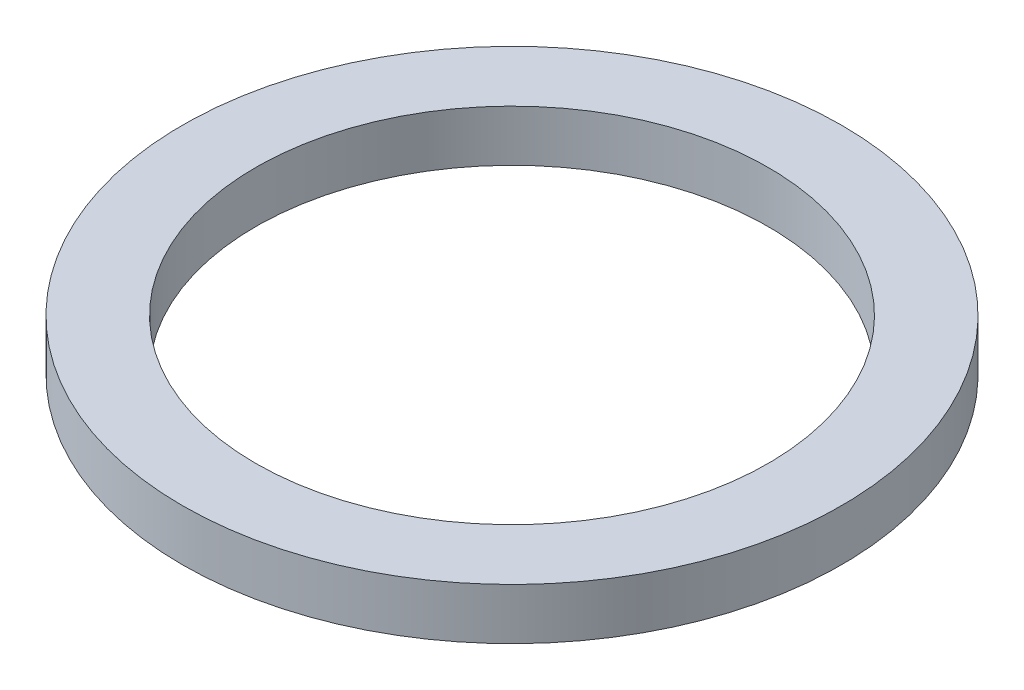
ISO-10303-21;
HEADER;
FILE_DESCRIPTION(('STEP AP214'),'2;1');
FILE_NAME('part.step','',(''),(''),'','','');
FILE_SCHEMA(('AUTOMOTIVE_DESIGN { 1 0 10303 214 1 1 1 1 }'));
ENDSEC;
DATA;
#1=APPLICATION_CONTEXT('core data for automotive mechanical design processes');
#2=APPLICATION_PROTOCOL_DEFINITION('international standard','automotive_design',2000,#1);
#3=PRODUCT_CONTEXT('',#1,'mechanical');
#4=PRODUCT('Part','Part','',(#3));
#5=PRODUCT_RELATED_PRODUCT_CATEGORY('part','',(#4));
#6=PRODUCT_DEFINITION_FORMATION('','',#4);
#7=PRODUCT_DEFINITION_CONTEXT('part definition',#1,'design');
#8=PRODUCT_DEFINITION('design','',#6,#7);
#9=PRODUCT_DEFINITION_SHAPE('','',#8);
#10=(LENGTH_UNIT() NAMED_UNIT(*) SI_UNIT(.MILLI.,.METRE.));
#11=(NAMED_UNIT(*) PLANE_ANGLE_UNIT() SI_UNIT($,.RADIAN.));
#12=(NAMED_UNIT(*) SI_UNIT($,.STERADIAN.) SOLID_ANGLE_UNIT());
#13=UNCERTAINTY_MEASURE_WITH_UNIT(LENGTH_MEASURE(1.E-05),#10,'distance_accuracy_value','');
#14=(GEOMETRIC_REPRESENTATION_CONTEXT(3) GLOBAL_UNCERTAINTY_ASSIGNED_CONTEXT((#13)) GLOBAL_UNIT_ASSIGNED_CONTEXT((#10,
#11,#12)) REPRESENTATION_CONTEXT('',''));
#15=CARTESIAN_POINT('',(0.,0.,0.));
#16=DIRECTION('',(0.,0.,1.));
#17=DIRECTION('',(1.,0.,0.));
#18=AXIS2_PLACEMENT_3D('',#15,#16,#17);
#19=CARTESIAN_POINT('',(0.,7.,0.));
#20=DIRECTION('',(0.,-1.,0.));
#21=DIRECTION('',(0.,0.,-1.));
#22=AXIS2_PLACEMENT_3D('',#19,#20,#21);
#23=CYLINDRICAL_SURFACE('',#22,45.);
#24=CARTESIAN_POINT('',(0.,7.,0.));
#25=DIRECTION('',(0.,1.,0.));
#26=DIRECTION('',(0.,0.,1.));
#27=AXIS2_PLACEMENT_3D('',#24,#25,#26);
#28=CIRCLE('',#27,45.);
#29=CARTESIAN_POINT('',(0.,7.,45.));
#30=VERTEX_POINT('',#29);
#31=EDGE_CURVE('E10',#30,#30,#28,.T.);
#32=ORIENTED_EDGE('',*,*,#31,.F.);
#33=EDGE_LOOP('',(#32));
#34=FACE_BOUND('',#33,.T.);
#35=CARTESIAN_POINT('',(0.,0.,0.));
#36=DIRECTION('',(0.,1.,0.));
#37=DIRECTION('',(0.,0.,1.));
#38=AXIS2_PLACEMENT_3D('',#35,#36,#37);
#39=CIRCLE('',#38,45.);
#40=CARTESIAN_POINT('',(0.,0.,45.));
#41=VERTEX_POINT('',#40);
#42=EDGE_CURVE('E37',#41,#41,#39,.T.);
#43=ORIENTED_EDGE('',*,*,#42,.T.);
#44=EDGE_LOOP('',(#43));
#45=FACE_BOUND('',#44,.T.);
#46=ADVANCED_FACE('F40',(#34,#45),#23,.T.);
#47=CARTESIAN_POINT('',(0.,7.,0.));
#48=DIRECTION('',(0.,1.,0.));
#49=DIRECTION('',(0.,0.,1.));
#50=AXIS2_PLACEMENT_3D('',#47,#48,#49);
#51=PLANE('',#50);
#52=CARTESIAN_POINT('',(0.,7.,0.));
#53=DIRECTION('',(0.,1.,0.));
#54=DIRECTION('',(0.,0.,1.));
#55=AXIS2_PLACEMENT_3D('',#52,#53,#54);
#56=CIRCLE('',#55,35.);
#57=CARTESIAN_POINT('',(0.,7.,35.));
#58=VERTEX_POINT('',#57);
#59=EDGE_CURVE('E50',#58,#58,#56,.T.);
#60=ORIENTED_EDGE('',*,*,#59,.F.);
#61=EDGE_LOOP('',(#60));
#62=FACE_BOUND('',#61,.T.);
#63=ORIENTED_EDGE('',*,*,#31,.T.);
#64=EDGE_LOOP('',(#63));
#65=FACE_BOUND('',#64,.T.);
#66=ADVANCED_FACE('F59',(#62,#65),#51,.T.);
#67=CARTESIAN_POINT('',(0.,0.,0.));
#68=DIRECTION('',(0.,1.,0.));
#69=DIRECTION('',(0.,0.,1.));
#70=AXIS2_PLACEMENT_3D('',#67,#68,#69);
#71=PLANE('',#70);
#72=CARTESIAN_POINT('',(0.,0.,0.));
#73=DIRECTION('',(0.,1.,0.));
#74=DIRECTION('',(0.,0.,1.));
#75=AXIS2_PLACEMENT_3D('',#72,#73,#74);
#76=CIRCLE('',#75,35.);
#77=CARTESIAN_POINT('',(0.,0.,35.));
#78=VERTEX_POINT('',#77);
#79=EDGE_CURVE('E47',#78,#78,#76,.T.);
#80=ORIENTED_EDGE('',*,*,#79,.T.);
#81=EDGE_LOOP('',(#80));
#82=FACE_BOUND('',#81,.T.);
#83=ORIENTED_EDGE('',*,*,#42,.F.);
#84=EDGE_LOOP('',(#83));
#85=FACE_BOUND('',#84,.T.);
#86=ADVANCED_FACE('F58',(#82,#85),#71,.F.);
#87=CARTESIAN_POINT('',(0.,7.,0.));
#88=DIRECTION('',(0.,-1.,0.));
#89=DIRECTION('',(0.,0.,-1.));
#90=AXIS2_PLACEMENT_3D('',#87,#88,#89);
#91=CYLINDRICAL_SURFACE('',#90,35.);
#92=ORIENTED_EDGE('',*,*,#59,.T.);
#93=EDGE_LOOP('',(#92));
#94=FACE_BOUND('',#93,.T.);
#95=ORIENTED_EDGE('',*,*,#79,.F.);
#96=EDGE_LOOP('',(#95));
#97=FACE_BOUND('',#96,.T.);
#98=ADVANCED_FACE('F54',(#94,#97),#91,.F.);
#99=CLOSED_SHELL('',(#46,#66,#86,#98));
#100=MANIFOLD_SOLID_BREP('B2',#99);
#101=ADVANCED_BREP_SHAPE_REPRESENTATION('',(#18,#100),#14);
#102=SHAPE_DEFINITION_REPRESENTATION(#9,#101);
ENDSEC;
END-ISO-10303-21;
